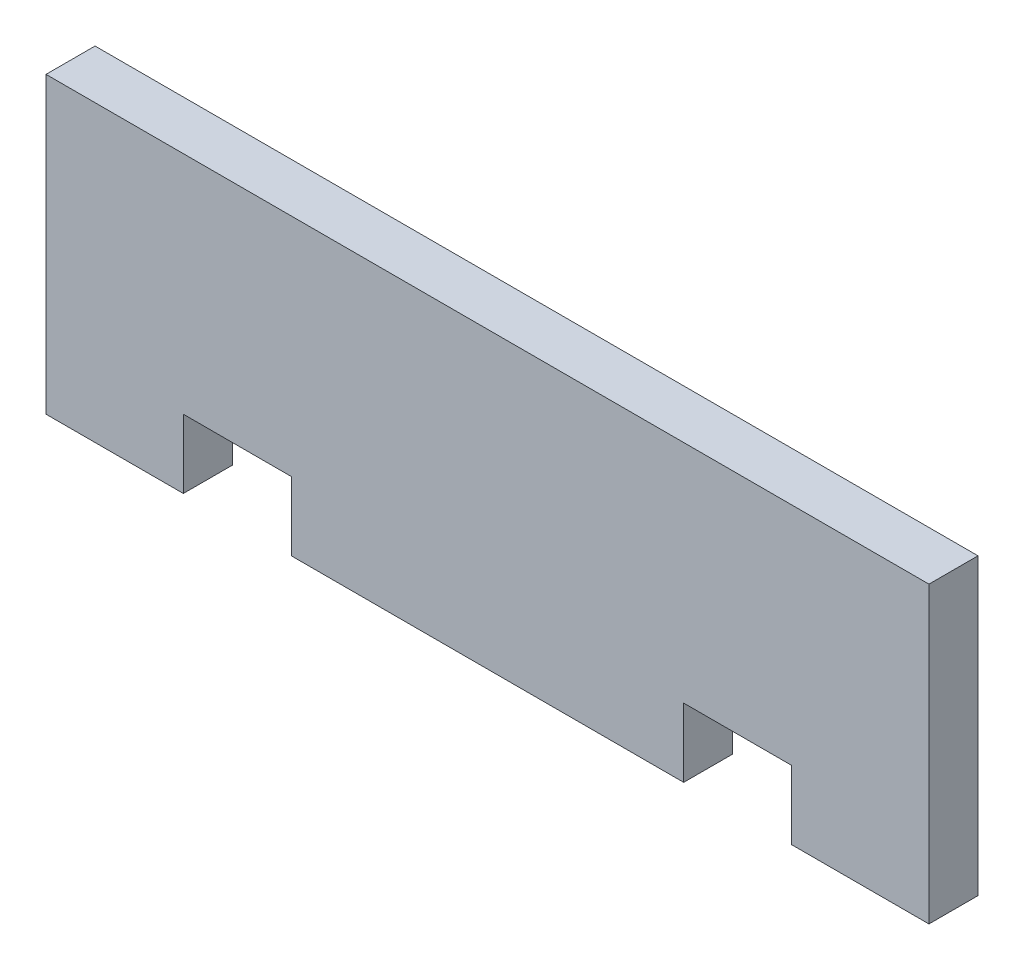
ISO-10303-21;
HEADER;
FILE_DESCRIPTION(('STEP AP214'),'2;1');
FILE_NAME('part.step','',(''),(''),'','','');
FILE_SCHEMA(('AUTOMOTIVE_DESIGN { 1 0 10303 214 1 1 1 1 }'));
ENDSEC;
DATA;
#1=APPLICATION_CONTEXT('core data for automotive mechanical design processes');
#2=APPLICATION_PROTOCOL_DEFINITION('international standard','automotive_design',2000,#1);
#3=PRODUCT_CONTEXT('',#1,'mechanical');
#4=PRODUCT('Part','Part','',(#3));
#5=PRODUCT_RELATED_PRODUCT_CATEGORY('part','',(#4));
#6=PRODUCT_DEFINITION_FORMATION('','',#4);
#7=PRODUCT_DEFINITION_CONTEXT('part definition',#1,'design');
#8=PRODUCT_DEFINITION('design','',#6,#7);
#9=PRODUCT_DEFINITION_SHAPE('','',#8);
#10=(LENGTH_UNIT() NAMED_UNIT(*) SI_UNIT(.MILLI.,.METRE.));
#11=(NAMED_UNIT(*) PLANE_ANGLE_UNIT() SI_UNIT($,.RADIAN.));
#12=(NAMED_UNIT(*) SI_UNIT($,.STERADIAN.) SOLID_ANGLE_UNIT());
#13=UNCERTAINTY_MEASURE_WITH_UNIT(LENGTH_MEASURE(1.E-05),#10,'distance_accuracy_value','');
#14=(GEOMETRIC_REPRESENTATION_CONTEXT(3) GLOBAL_UNCERTAINTY_ASSIGNED_CONTEXT((#13)) GLOBAL_UNIT_ASSIGNED_CONTEXT((#10,
#11,#12)) REPRESENTATION_CONTEXT('',''));
#15=CARTESIAN_POINT('',(0.,0.,0.));
#16=DIRECTION('',(0.,0.,1.));
#17=DIRECTION('',(1.,0.,0.));
#18=AXIS2_PLACEMENT_3D('',#15,#16,#17);
#19=CARTESIAN_POINT('',(-57.15,38.1,6.35));
#20=DIRECTION('',(1.,0.,0.));
#21=DIRECTION('',(0.,0.,-1.));
#22=AXIS2_PLACEMENT_3D('',#19,#20,#21);
#23=PLANE('',#22);
#24=DIRECTION('',(0.,-1.,0.));
#25=VECTOR('',#24,1.);
#26=CARTESIAN_POINT('',(-57.15,38.1,0.));
#27=LINE('',#26,#25);
#28=CARTESIAN_POINT('',(-57.15,38.1,0.));
#29=VERTEX_POINT('',#28);
#30=CARTESIAN_POINT('',(-57.15,0.,0.));
#31=VERTEX_POINT('',#30);
#32=EDGE_CURVE('E156',#29,#31,#27,.T.);
#33=ORIENTED_EDGE('',*,*,#32,.T.);
#34=DIRECTION('',(0.,0.,-1.));
#35=VECTOR('',#34,1.);
#36=CARTESIAN_POINT('',(-57.15,0.,6.35));
#37=LINE('',#36,#35);
#38=CARTESIAN_POINT('',(-57.15,0.,6.35));
#39=VERTEX_POINT('',#38);
#40=EDGE_CURVE('E11',#39,#31,#37,.T.);
#41=ORIENTED_EDGE('',*,*,#40,.F.);
#42=DIRECTION('',(0.,-1.,0.));
#43=VECTOR('',#42,1.);
#44=CARTESIAN_POINT('',(-57.15,38.1,6.35));
#45=LINE('',#44,#43);
#46=CARTESIAN_POINT('',(-57.15,38.1,6.35));
#47=VERTEX_POINT('',#46);
#48=EDGE_CURVE('E179',#47,#39,#45,.T.);
#49=ORIENTED_EDGE('',*,*,#48,.F.);
#50=DIRECTION('',(0.,0.,-1.));
#51=VECTOR('',#50,1.);
#52=CARTESIAN_POINT('',(-57.15,38.1,6.35));
#53=LINE('',#52,#51);
#54=EDGE_CURVE('E152',#47,#29,#53,.T.);
#55=ORIENTED_EDGE('',*,*,#54,.T.);
#56=EDGE_LOOP('',(#33,#41,#49,#55));
#57=FACE_BOUND('',#56,.T.);
#58=ADVANCED_FACE('F33',(#57),#23,.F.);
#59=CARTESIAN_POINT('',(-39.37,0.,6.35));
#60=DIRECTION('',(0.,1.,0.));
#61=DIRECTION('',(0.,0.,1.));
#62=AXIS2_PLACEMENT_3D('',#59,#60,#61);
#63=PLANE('',#62);
#64=DIRECTION('',(1.,0.,0.));
#65=VECTOR('',#64,1.);
#66=CARTESIAN_POINT('',(-39.37,0.,0.));
#67=LINE('',#66,#65);
#68=CARTESIAN_POINT('',(-39.37,0.,0.));
#69=VERTEX_POINT('',#68);
#70=EDGE_CURVE('E159',#31,#69,#67,.T.);
#71=ORIENTED_EDGE('',*,*,#70,.T.);
#72=DIRECTION('',(0.,0.,-1.));
#73=VECTOR('',#72,1.);
#74=CARTESIAN_POINT('',(-39.37,0.,6.35));
#75=LINE('',#74,#73);
#76=CARTESIAN_POINT('',(-39.37,0.,6.35));
#77=VERTEX_POINT('',#76);
#78=EDGE_CURVE('E41',#77,#69,#75,.T.);
#79=ORIENTED_EDGE('',*,*,#78,.F.);
#80=DIRECTION('',(1.,0.,0.));
#81=VECTOR('',#80,1.);
#82=CARTESIAN_POINT('',(-39.37,0.,6.35));
#83=LINE('',#82,#81);
#84=EDGE_CURVE('E105',#39,#77,#83,.T.);
#85=ORIENTED_EDGE('',*,*,#84,.F.);
#86=ORIENTED_EDGE('',*,*,#40,.T.);
#87=EDGE_LOOP('',(#71,#79,#85,#86));
#88=FACE_BOUND('',#87,.T.);
#89=ADVANCED_FACE('F257',(#88),#63,.F.);
#90=CARTESIAN_POINT('',(-39.37,8.89,6.35));
#91=DIRECTION('',(-1.,0.,0.));
#92=DIRECTION('',(0.,0.,1.));
#93=AXIS2_PLACEMENT_3D('',#90,#91,#92);
#94=PLANE('',#93);
#95=DIRECTION('',(0.,1.,0.));
#96=VECTOR('',#95,1.);
#97=CARTESIAN_POINT('',(-39.37,8.89,0.));
#98=LINE('',#97,#96);
#99=CARTESIAN_POINT('',(-39.37,8.89,0.));
#100=VERTEX_POINT('',#99);
#101=EDGE_CURVE('E162',#69,#100,#98,.T.);
#102=ORIENTED_EDGE('',*,*,#101,.T.);
#103=DIRECTION('',(0.,0.,-1.));
#104=VECTOR('',#103,1.);
#105=CARTESIAN_POINT('',(-39.37,8.89,6.35));
#106=LINE('',#105,#104);
#107=CARTESIAN_POINT('',(-39.37,8.89,6.35));
#108=VERTEX_POINT('',#107);
#109=EDGE_CURVE('E198',#108,#100,#106,.T.);
#110=ORIENTED_EDGE('',*,*,#109,.F.);
#111=DIRECTION('',(0.,1.,0.));
#112=VECTOR('',#111,1.);
#113=CARTESIAN_POINT('',(-39.37,8.89,6.35));
#114=LINE('',#113,#112);
#115=EDGE_CURVE('E206',#77,#108,#114,.T.);
#116=ORIENTED_EDGE('',*,*,#115,.F.);
#117=ORIENTED_EDGE('',*,*,#78,.T.);
#118=EDGE_LOOP('',(#102,#110,#116,#117));
#119=FACE_BOUND('',#118,.T.);
#120=ADVANCED_FACE('F204',(#119),#94,.F.);
#121=CARTESIAN_POINT('',(-39.37,8.89,6.35));
#122=DIRECTION('',(0.,1.,0.));
#123=DIRECTION('',(0.,0.,1.));
#124=AXIS2_PLACEMENT_3D('',#121,#122,#123);
#125=PLANE('',#124);
#126=CARTESIAN_POINT('',(-32.766,8.89,3.175));
#127=DIRECTION('',(0.,-1.,0.));
#128=DIRECTION('',(0.,0.,-1.));
#129=AXIS2_PLACEMENT_3D('',#126,#127,#128);
#130=CIRCLE('',#129,1.78600099999999);
#131=CARTESIAN_POINT('',(-32.766,8.89,1.38899900000001));
#132=VERTEX_POINT('',#131);
#133=EDGE_CURVE('E376',#132,#132,#130,.T.);
#134=ORIENTED_EDGE('',*,*,#133,.F.);
#135=EDGE_LOOP('',(#134));
#136=FACE_BOUND('',#135,.T.);
#137=DIRECTION('',(1.,0.,0.));
#138=VECTOR('',#137,1.);
#139=CARTESIAN_POINT('',(-39.37,8.89,0.));
#140=LINE('',#139,#138);
#141=CARTESIAN_POINT('',(-25.4,8.89,0.));
#142=VERTEX_POINT('',#141);
#143=EDGE_CURVE('E164',#100,#142,#140,.T.);
#144=ORIENTED_EDGE('',*,*,#143,.T.);
#145=DIRECTION('',(0.,0.,-1.));
#146=VECTOR('',#145,1.);
#147=CARTESIAN_POINT('',(-25.4,8.89,6.35));
#148=LINE('',#147,#146);
#149=CARTESIAN_POINT('',(-25.4,8.89,6.35));
#150=VERTEX_POINT('',#149);
#151=EDGE_CURVE('E195',#150,#142,#148,.T.);
#152=ORIENTED_EDGE('',*,*,#151,.F.);
#153=DIRECTION('',(1.,0.,0.));
#154=VECTOR('',#153,1.);
#155=CARTESIAN_POINT('',(-39.37,8.89,6.35));
#156=LINE('',#155,#154);
#157=EDGE_CURVE('E224',#108,#150,#156,.T.);
#158=ORIENTED_EDGE('',*,*,#157,.F.);
#159=ORIENTED_EDGE('',*,*,#109,.T.);
#160=EDGE_LOOP('',(#144,#152,#158,#159));
#161=FACE_BOUND('',#160,.T.);
#162=ADVANCED_FACE('F215',(#136,#161),#125,.F.);
#163=CARTESIAN_POINT('',(-25.4,8.89,6.35));
#164=DIRECTION('',(1.,0.,0.));
#165=DIRECTION('',(0.,0.,-1.));
#166=AXIS2_PLACEMENT_3D('',#163,#164,#165);
#167=PLANE('',#166);
#168=DIRECTION('',(0.,-1.,0.));
#169=VECTOR('',#168,1.);
#170=CARTESIAN_POINT('',(-25.4,8.89,0.));
#171=LINE('',#170,#169);
#172=CARTESIAN_POINT('',(-25.4,0.,0.));
#173=VERTEX_POINT('',#172);
#174=EDGE_CURVE('E166',#142,#173,#171,.T.);
#175=ORIENTED_EDGE('',*,*,#174,.T.);
#176=DIRECTION('',(0.,0.,-1.));
#177=VECTOR('',#176,1.);
#178=CARTESIAN_POINT('',(-25.4,0.,6.35));
#179=LINE('',#178,#177);
#180=CARTESIAN_POINT('',(-25.4,0.,6.35));
#181=VERTEX_POINT('',#180);
#182=EDGE_CURVE('E192',#181,#173,#179,.T.);
#183=ORIENTED_EDGE('',*,*,#182,.F.);
#184=DIRECTION('',(0.,-1.,0.));
#185=VECTOR('',#184,1.);
#186=CARTESIAN_POINT('',(-25.4,8.89,6.35));
#187=LINE('',#186,#185);
#188=EDGE_CURVE('E221',#150,#181,#187,.T.);
#189=ORIENTED_EDGE('',*,*,#188,.F.);
#190=ORIENTED_EDGE('',*,*,#151,.T.);
#191=EDGE_LOOP('',(#175,#183,#189,#190));
#192=FACE_BOUND('',#191,.T.);
#193=ADVANCED_FACE('F219',(#192),#167,.F.);
#194=CARTESIAN_POINT('',(-25.4,0.,6.35));
#195=DIRECTION('',(0.,1.,0.));
#196=DIRECTION('',(-1.,0.,0.));
#197=AXIS2_PLACEMENT_3D('',#194,#195,#196);
#198=PLANE('',#197);
#199=DIRECTION('',(1.,0.,0.));
#200=VECTOR('',#199,1.);
#201=CARTESIAN_POINT('',(-25.4,0.,0.));
#202=LINE('',#201,#200);
#203=CARTESIAN_POINT('',(25.4,0.,0.));
#204=VERTEX_POINT('',#203);
#205=EDGE_CURVE('E168',#173,#204,#202,.T.);
#206=ORIENTED_EDGE('',*,*,#205,.T.);
#207=DIRECTION('',(0.,0.,-1.));
#208=VECTOR('',#207,1.);
#209=CARTESIAN_POINT('',(25.4,0.,6.35));
#210=LINE('',#209,#208);
#211=CARTESIAN_POINT('',(25.4,0.,6.35));
#212=VERTEX_POINT('',#211);
#213=EDGE_CURVE('E189',#212,#204,#210,.T.);
#214=ORIENTED_EDGE('',*,*,#213,.F.);
#215=DIRECTION('',(1.,0.,0.));
#216=VECTOR('',#215,1.);
#217=CARTESIAN_POINT('',(-25.4,0.,6.35));
#218=LINE('',#217,#216);
#219=EDGE_CURVE('E223',#181,#212,#218,.T.);
#220=ORIENTED_EDGE('',*,*,#219,.F.);
#221=ORIENTED_EDGE('',*,*,#182,.T.);
#222=EDGE_LOOP('',(#206,#214,#220,#221));
#223=FACE_BOUND('',#222,.T.);
#224=ADVANCED_FACE('F271',(#223),#198,.F.);
#225=CARTESIAN_POINT('',(25.4,0.,6.35));
#226=DIRECTION('',(-1.,0.,0.));
#227=DIRECTION('',(0.,0.,1.));
#228=AXIS2_PLACEMENT_3D('',#225,#226,#227);
#229=PLANE('',#228);
#230=DIRECTION('',(0.,1.,0.));
#231=VECTOR('',#230,1.);
#232=CARTESIAN_POINT('',(25.4,0.,0.));
#233=LINE('',#232,#231);
#234=CARTESIAN_POINT('',(25.4,8.89,0.));
#235=VERTEX_POINT('',#234);
#236=EDGE_CURVE('E170',#204,#235,#233,.T.);
#237=ORIENTED_EDGE('',*,*,#236,.T.);
#238=DIRECTION('',(0.,0.,-1.));
#239=VECTOR('',#238,1.);
#240=CARTESIAN_POINT('',(25.4,8.89,6.35));
#241=LINE('',#240,#239);
#242=CARTESIAN_POINT('',(25.4,8.89,6.35));
#243=VERTEX_POINT('',#242);
#244=EDGE_CURVE('E186',#243,#235,#241,.T.);
#245=ORIENTED_EDGE('',*,*,#244,.F.);
#246=DIRECTION('',(0.,1.,0.));
#247=VECTOR('',#246,1.);
#248=CARTESIAN_POINT('',(25.4,0.,6.35));
#249=LINE('',#248,#247);
#250=EDGE_CURVE('E226',#212,#243,#249,.T.);
#251=ORIENTED_EDGE('',*,*,#250,.F.);
#252=ORIENTED_EDGE('',*,*,#213,.T.);
#253=EDGE_LOOP('',(#237,#245,#251,#252));
#254=FACE_BOUND('',#253,.T.);
#255=ADVANCED_FACE('F274',(#254),#229,.F.);
#256=CARTESIAN_POINT('',(25.4,8.89,6.35));
#257=DIRECTION('',(0.,1.,0.));
#258=DIRECTION('',(0.,0.,1.));
#259=AXIS2_PLACEMENT_3D('',#256,#257,#258);
#260=PLANE('',#259);
#261=CARTESIAN_POINT('',(32.766,8.89,3.175));
#262=DIRECTION('',(0.,-1.,0.));
#263=DIRECTION('',(0.,0.,-1.));
#264=AXIS2_PLACEMENT_3D('',#261,#262,#263);
#265=CIRCLE('',#264,1.78600099999999);
#266=CARTESIAN_POINT('',(32.766,8.89,1.38899900000001));
#267=VERTEX_POINT('',#266);
#268=EDGE_CURVE('E378',#267,#267,#265,.T.);
#269=ORIENTED_EDGE('',*,*,#268,.F.);
#270=EDGE_LOOP('',(#269));
#271=FACE_BOUND('',#270,.T.);
#272=DIRECTION('',(1.,0.,0.));
#273=VECTOR('',#272,1.);
#274=CARTESIAN_POINT('',(25.4,8.89,0.));
#275=LINE('',#274,#273);
#276=CARTESIAN_POINT('',(39.37,8.89,0.));
#277=VERTEX_POINT('',#276);
#278=EDGE_CURVE('E172',#235,#277,#275,.T.);
#279=ORIENTED_EDGE('',*,*,#278,.T.);
#280=DIRECTION('',(0.,0.,-1.));
#281=VECTOR('',#280,1.);
#282=CARTESIAN_POINT('',(39.37,8.89,6.35));
#283=LINE('',#282,#281);
#284=CARTESIAN_POINT('',(39.37,8.89,6.35));
#285=VERTEX_POINT('',#284);
#286=EDGE_CURVE('E183',#285,#277,#283,.T.);
#287=ORIENTED_EDGE('',*,*,#286,.F.);
#288=DIRECTION('',(1.,0.,0.));
#289=VECTOR('',#288,1.);
#290=CARTESIAN_POINT('',(25.4,8.89,6.35));
#291=LINE('',#290,#289);
#292=EDGE_CURVE('E232',#243,#285,#291,.T.);
#293=ORIENTED_EDGE('',*,*,#292,.F.);
#294=ORIENTED_EDGE('',*,*,#244,.T.);
#295=EDGE_LOOP('',(#279,#287,#293,#294));
#296=FACE_BOUND('',#295,.T.);
#297=ADVANCED_FACE('F238',(#271,#296),#260,.F.);
#298=CARTESIAN_POINT('',(39.37,8.89,6.35));
#299=DIRECTION('',(1.,0.,0.));
#300=DIRECTION('',(0.,1.,0.));
#301=AXIS2_PLACEMENT_3D('',#298,#299,#300);
#302=PLANE('',#301);
#303=DIRECTION('',(0.,-1.,0.));
#304=VECTOR('',#303,1.);
#305=CARTESIAN_POINT('',(39.37,8.89,0.));
#306=LINE('',#305,#304);
#307=CARTESIAN_POINT('',(39.37,0.,0.));
#308=VERTEX_POINT('',#307);
#309=EDGE_CURVE('E174',#277,#308,#306,.T.);
#310=ORIENTED_EDGE('',*,*,#309,.T.);
#311=DIRECTION('',(0.,0.,-1.));
#312=VECTOR('',#311,1.);
#313=CARTESIAN_POINT('',(39.37,0.,6.35));
#314=LINE('',#313,#312);
#315=CARTESIAN_POINT('',(39.37,0.,6.35));
#316=VERTEX_POINT('',#315);
#317=EDGE_CURVE('E147',#316,#308,#314,.T.);
#318=ORIENTED_EDGE('',*,*,#317,.F.);
#319=DIRECTION('',(0.,-1.,0.));
#320=VECTOR('',#319,1.);
#321=CARTESIAN_POINT('',(39.37,8.89,6.35));
#322=LINE('',#321,#320);
#323=EDGE_CURVE('E138',#285,#316,#322,.T.);
#324=ORIENTED_EDGE('',*,*,#323,.F.);
#325=ORIENTED_EDGE('',*,*,#286,.T.);
#326=EDGE_LOOP('',(#310,#318,#324,#325));
#327=FACE_BOUND('',#326,.T.);
#328=ADVANCED_FACE('F242',(#327),#302,.F.);
#329=CARTESIAN_POINT('',(39.37,0.,6.35));
#330=DIRECTION('',(0.,1.,0.));
#331=DIRECTION('',(0.,0.,1.));
#332=AXIS2_PLACEMENT_3D('',#329,#330,#331);
#333=PLANE('',#332);
#334=DIRECTION('',(1.,0.,0.));
#335=VECTOR('',#334,1.);
#336=CARTESIAN_POINT('',(39.37,0.,0.));
#337=LINE('',#336,#335);
#338=CARTESIAN_POINT('',(57.15,0.,0.));
#339=VERTEX_POINT('',#338);
#340=EDGE_CURVE('E146',#308,#339,#337,.T.);
#341=ORIENTED_EDGE('',*,*,#340,.T.);
#342=DIRECTION('',(0.,0.,-1.));
#343=VECTOR('',#342,1.);
#344=CARTESIAN_POINT('',(57.15,0.,6.35));
#345=LINE('',#344,#343);
#346=CARTESIAN_POINT('',(57.15,0.,6.35));
#347=VERTEX_POINT('',#346);
#348=EDGE_CURVE('E143',#347,#339,#345,.T.);
#349=ORIENTED_EDGE('',*,*,#348,.F.);
#350=DIRECTION('',(1.,0.,0.));
#351=VECTOR('',#350,1.);
#352=CARTESIAN_POINT('',(39.37,0.,6.35));
#353=LINE('',#352,#351);
#354=EDGE_CURVE('E132',#316,#347,#353,.T.);
#355=ORIENTED_EDGE('',*,*,#354,.F.);
#356=ORIENTED_EDGE('',*,*,#317,.T.);
#357=EDGE_LOOP('',(#341,#349,#355,#356));
#358=FACE_BOUND('',#357,.T.);
#359=ADVANCED_FACE('F144',(#358),#333,.F.);
#360=CARTESIAN_POINT('',(57.15,0.,6.35));
#361=DIRECTION('',(-1.,0.,0.));
#362=DIRECTION('',(0.,0.,1.));
#363=AXIS2_PLACEMENT_3D('',#360,#361,#362);
#364=PLANE('',#363);
#365=DIRECTION('',(0.,1.,0.));
#366=VECTOR('',#365,1.);
#367=CARTESIAN_POINT('',(57.15,0.,0.));
#368=LINE('',#367,#366);
#369=CARTESIAN_POINT('',(57.15,38.1,0.));
#370=VERTEX_POINT('',#369);
#371=EDGE_CURVE('E91',#339,#370,#368,.T.);
#372=ORIENTED_EDGE('',*,*,#371,.T.);
#373=DIRECTION('',(0.,0.,-1.));
#374=VECTOR('',#373,1.);
#375=CARTESIAN_POINT('',(57.15,38.1,6.35));
#376=LINE('',#375,#374);
#377=CARTESIAN_POINT('',(57.15,38.1,6.35));
#378=VERTEX_POINT('',#377);
#379=EDGE_CURVE('E148',#378,#370,#376,.T.);
#380=ORIENTED_EDGE('',*,*,#379,.F.);
#381=DIRECTION('',(0.,1.,0.));
#382=VECTOR('',#381,1.);
#383=CARTESIAN_POINT('',(57.15,0.,6.35));
#384=LINE('',#383,#382);
#385=EDGE_CURVE('E136',#347,#378,#384,.T.);
#386=ORIENTED_EDGE('',*,*,#385,.F.);
#387=ORIENTED_EDGE('',*,*,#348,.T.);
#388=EDGE_LOOP('',(#372,#380,#386,#387));
#389=FACE_BOUND('',#388,.T.);
#390=ADVANCED_FACE('F150',(#389),#364,.F.);
#391=CARTESIAN_POINT('',(57.15,38.1,6.35));
#392=DIRECTION('',(0.,-1.,0.));
#393=DIRECTION('',(0.,0.,-1.));
#394=AXIS2_PLACEMENT_3D('',#391,#392,#393);
#395=PLANE('',#394);
#396=DIRECTION('',(-1.,0.,0.));
#397=VECTOR('',#396,1.);
#398=CARTESIAN_POINT('',(57.15,38.1,0.));
#399=LINE('',#398,#397);
#400=EDGE_CURVE('E97',#370,#29,#399,.T.);
#401=ORIENTED_EDGE('',*,*,#400,.T.);
#402=ORIENTED_EDGE('',*,*,#54,.F.);
#403=DIRECTION('',(-1.,0.,0.));
#404=VECTOR('',#403,1.);
#405=CARTESIAN_POINT('',(57.15,38.1,6.35));
#406=LINE('',#405,#404);
#407=EDGE_CURVE('E49',#378,#47,#406,.T.);
#408=ORIENTED_EDGE('',*,*,#407,.F.);
#409=ORIENTED_EDGE('',*,*,#379,.T.);
#410=EDGE_LOOP('',(#401,#402,#408,#409));
#411=FACE_BOUND('',#410,.T.);
#412=ADVANCED_FACE('F246',(#411),#395,.F.);
#413=CARTESIAN_POINT('',(-57.15,0.,6.35));
#414=DIRECTION('',(0.,0.,-1.));
#415=DIRECTION('',(-1.,0.,0.));
#416=AXIS2_PLACEMENT_3D('',#413,#414,#415);
#417=PLANE('',#416);
#418=ORIENTED_EDGE('',*,*,#48,.T.);
#419=ORIENTED_EDGE('',*,*,#84,.T.);
#420=ORIENTED_EDGE('',*,*,#115,.T.);
#421=ORIENTED_EDGE('',*,*,#157,.T.);
#422=ORIENTED_EDGE('',*,*,#188,.T.);
#423=ORIENTED_EDGE('',*,*,#219,.T.);
#424=ORIENTED_EDGE('',*,*,#250,.T.);
#425=ORIENTED_EDGE('',*,*,#292,.T.);
#426=ORIENTED_EDGE('',*,*,#323,.T.);
#427=ORIENTED_EDGE('',*,*,#354,.T.);
#428=ORIENTED_EDGE('',*,*,#385,.T.);
#429=ORIENTED_EDGE('',*,*,#407,.T.);
#430=EDGE_LOOP('',(#418,#419,#420,#421,#422,#423,#424,#425,#426,#427,#428,#429));
#431=FACE_BOUND('',#430,.T.);
#432=ADVANCED_FACE('F134',(#431),#417,.F.);
#433=CARTESIAN_POINT('',(-57.15,0.,0.));
#434=DIRECTION('',(0.,0.,-1.));
#435=DIRECTION('',(-1.,0.,0.));
#436=AXIS2_PLACEMENT_3D('',#433,#434,#435);
#437=PLANE('',#436);
#438=ORIENTED_EDGE('',*,*,#32,.F.);
#439=ORIENTED_EDGE('',*,*,#400,.F.);
#440=ORIENTED_EDGE('',*,*,#371,.F.);
#441=ORIENTED_EDGE('',*,*,#340,.F.);
#442=ORIENTED_EDGE('',*,*,#309,.F.);
#443=ORIENTED_EDGE('',*,*,#278,.F.);
#444=ORIENTED_EDGE('',*,*,#236,.F.);
#445=ORIENTED_EDGE('',*,*,#205,.F.);
#446=ORIENTED_EDGE('',*,*,#174,.F.);
#447=ORIENTED_EDGE('',*,*,#143,.F.);
#448=ORIENTED_EDGE('',*,*,#101,.F.);
#449=ORIENTED_EDGE('',*,*,#70,.F.);
#450=EDGE_LOOP('',(#438,#439,#440,#441,#442,#443,#444,#445,#446,#447,#448,#449));
#451=FACE_BOUND('',#450,.T.);
#452=ADVANCED_FACE('F210',(#451),#437,.T.);
#453=CARTESIAN_POINT('',(32.766,21.59,3.175));
#454=DIRECTION('',(0.,-1.,0.));
#455=DIRECTION('',(0.,0.,-1.));
#456=AXIS2_PLACEMENT_3D('',#453,#454,#455);
#457=CONICAL_SURFACE('',#456,1.786001,1.02974425867665);
#458=CARTESIAN_POINT('',(32.766,22.6631376664438,3.175));
#459=VERTEX_POINT('',#458);
#460=VERTEX_LOOP('',#459);
#461=FACE_BOUND('',#460,.T.);
#462=CARTESIAN_POINT('',(32.766,21.59,3.175));
#463=DIRECTION('',(0.,-1.,0.));
#464=DIRECTION('',(0.,0.,-1.));
#465=AXIS2_PLACEMENT_3D('',#462,#463,#464);
#466=CIRCLE('',#465,1.786001);
#467=CARTESIAN_POINT('',(32.766,21.59,1.388999));
#468=VERTEX_POINT('',#467);
#469=EDGE_CURVE('E160',#468,#468,#466,.T.);
#470=ORIENTED_EDGE('',*,*,#469,.T.);
#471=EDGE_LOOP('',(#470));
#472=FACE_BOUND('',#471,.T.);
#473=ADVANCED_FACE('F312',(#461,#472),#457,.F.);
#474=CARTESIAN_POINT('',(32.766,8.89,3.175));
#475=DIRECTION('',(0.,-1.,0.));
#476=DIRECTION('',(0.,0.,-1.));
#477=AXIS2_PLACEMENT_3D('',#474,#475,#476);
#478=CYLINDRICAL_SURFACE('',#477,1.78600099999999);
#479=ORIENTED_EDGE('',*,*,#469,.F.);
#480=EDGE_LOOP('',(#479));
#481=FACE_BOUND('',#480,.T.);
#482=ORIENTED_EDGE('',*,*,#268,.T.);
#483=EDGE_LOOP('',(#482));
#484=FACE_BOUND('',#483,.T.);
#485=ADVANCED_FACE('F336',(#481,#484),#478,.F.);
#486=CARTESIAN_POINT('',(-32.766,21.59,3.175));
#487=DIRECTION('',(0.,-1.,0.));
#488=DIRECTION('',(0.,0.,-1.));
#489=AXIS2_PLACEMENT_3D('',#486,#487,#488);
#490=CONICAL_SURFACE('',#489,1.786001,1.02974425867665);
#491=CARTESIAN_POINT('',(-32.766,22.6631376664438,3.175));
#492=VERTEX_POINT('',#491);
#493=VERTEX_LOOP('',#492);
#494=FACE_BOUND('',#493,.T.);
#495=CARTESIAN_POINT('',(-32.766,21.59,3.175));
#496=DIRECTION('',(0.,-1.,0.));
#497=DIRECTION('',(0.,0.,-1.));
#498=AXIS2_PLACEMENT_3D('',#495,#496,#497);
#499=CIRCLE('',#498,1.786001);
#500=CARTESIAN_POINT('',(-32.766,21.59,1.388999));
#501=VERTEX_POINT('',#500);
#502=EDGE_CURVE('E373',#501,#501,#499,.T.);
#503=ORIENTED_EDGE('',*,*,#502,.T.);
#504=EDGE_LOOP('',(#503));
#505=FACE_BOUND('',#504,.T.);
#506=ADVANCED_FACE('F346',(#494,#505),#490,.F.);
#507=CARTESIAN_POINT('',(-32.766,8.89,3.175));
#508=DIRECTION('',(0.,-1.,0.));
#509=DIRECTION('',(0.,0.,-1.));
#510=AXIS2_PLACEMENT_3D('',#507,#508,#509);
#511=CYLINDRICAL_SURFACE('',#510,1.78600099999999);
#512=ORIENTED_EDGE('',*,*,#502,.F.);
#513=EDGE_LOOP('',(#512));
#514=FACE_BOUND('',#513,.T.);
#515=ORIENTED_EDGE('',*,*,#133,.T.);
#516=EDGE_LOOP('',(#515));
#517=FACE_BOUND('',#516,.T.);
#518=ADVANCED_FACE('F356',(#514,#517),#511,.F.);
#519=CLOSED_SHELL('',(#58,#89,#120,#162,#193,#224,#255,#297,#328,#359,#390,#412,#432,#452,#473,
#485,#506,#518));
#520=MANIFOLD_SOLID_BREP('B2',#519);
#521=ADVANCED_BREP_SHAPE_REPRESENTATION('',(#18,#520),#14);
#522=SHAPE_DEFINITION_REPRESENTATION(#9,#521);
ENDSEC;
END-ISO-10303-21;
